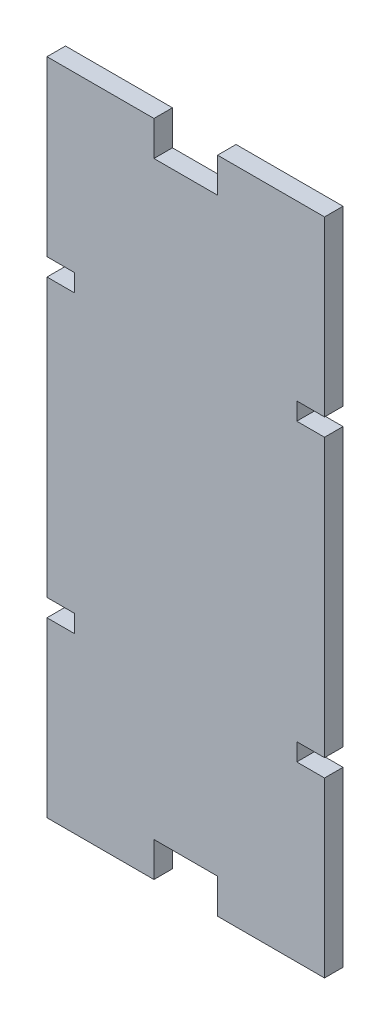
ISO-10303-21;
HEADER;
FILE_DESCRIPTION(('STEP AP214'),'2;1');
FILE_NAME('part.step','',(''),(''),'','','');
FILE_SCHEMA(('AUTOMOTIVE_DESIGN { 1 0 10303 214 1 1 1 1 }'));
ENDSEC;
DATA;
#1=APPLICATION_CONTEXT('core data for automotive mechanical design processes');
#2=APPLICATION_PROTOCOL_DEFINITION('international standard','automotive_design',2000,#1);
#3=PRODUCT_CONTEXT('',#1,'mechanical');
#4=PRODUCT('Part','Part','',(#3));
#5=PRODUCT_RELATED_PRODUCT_CATEGORY('part','',(#4));
#6=PRODUCT_DEFINITION_FORMATION('','',#4);
#7=PRODUCT_DEFINITION_CONTEXT('part definition',#1,'design');
#8=PRODUCT_DEFINITION('design','',#6,#7);
#9=PRODUCT_DEFINITION_SHAPE('','',#8);
#10=(LENGTH_UNIT() NAMED_UNIT(*) SI_UNIT(.MILLI.,.METRE.));
#11=(NAMED_UNIT(*) PLANE_ANGLE_UNIT() SI_UNIT($,.RADIAN.));
#12=(NAMED_UNIT(*) SI_UNIT($,.STERADIAN.) SOLID_ANGLE_UNIT());
#13=UNCERTAINTY_MEASURE_WITH_UNIT(LENGTH_MEASURE(1.E-05),#10,'distance_accuracy_value','');
#14=(GEOMETRIC_REPRESENTATION_CONTEXT(3) GLOBAL_UNCERTAINTY_ASSIGNED_CONTEXT((#13)) GLOBAL_UNIT_ASSIGNED_CONTEXT((#10,
#11,#12)) REPRESENTATION_CONTEXT('',''));
#15=CARTESIAN_POINT('',(0.,0.,0.));
#16=DIRECTION('',(0.,0.,1.));
#17=DIRECTION('',(1.,0.,0.));
#18=AXIS2_PLACEMENT_3D('',#15,#16,#17);
#19=CARTESIAN_POINT('',(38.1,-90.4875,5.08));
#20=DIRECTION('',(-1.,0.,0.));
#21=DIRECTION('',(0.,0.,1.));
#22=AXIS2_PLACEMENT_3D('',#19,#20,#21);
#23=PLANE('',#22);
#24=DIRECTION('',(0.,1.,0.));
#25=VECTOR('',#24,1.);
#26=CARTESIAN_POINT('',(38.1,-90.4875,0.));
#27=LINE('',#26,#25);
#28=CARTESIAN_POINT('',(38.1,-90.4875,0.));
#29=VERTEX_POINT('',#28);
#30=CARTESIAN_POINT('',(38.1,-42.926,0.));
#31=VERTEX_POINT('',#30);
#32=EDGE_CURVE('E471',#29,#31,#27,.T.);
#33=ORIENTED_EDGE('',*,*,#32,.T.);
#34=DIRECTION('',(0.,0.,1.));
#35=VECTOR('',#34,1.);
#36=CARTESIAN_POINT('',(38.1,-42.926,0.));
#37=LINE('',#36,#35);
#38=CARTESIAN_POINT('',(38.1,-42.926,5.08));
#39=VERTEX_POINT('',#38);
#40=EDGE_CURVE('E288',#31,#39,#37,.T.);
#41=ORIENTED_EDGE('',*,*,#40,.T.);
#42=DIRECTION('',(0.,1.,0.));
#43=VECTOR('',#42,1.);
#44=CARTESIAN_POINT('',(38.1,-90.4875,5.08));
#45=LINE('',#44,#43);
#46=CARTESIAN_POINT('',(38.1,-90.4875,5.08));
#47=VERTEX_POINT('',#46);
#48=EDGE_CURVE('E449',#47,#39,#45,.T.);
#49=ORIENTED_EDGE('',*,*,#48,.F.);
#50=DIRECTION('',(0.,0.,-1.));
#51=VECTOR('',#50,1.);
#52=CARTESIAN_POINT('',(38.1,-90.4875,5.08));
#53=LINE('',#52,#51);
#54=EDGE_CURVE('E470',#47,#29,#53,.T.);
#55=ORIENTED_EDGE('',*,*,#54,.T.);
#56=EDGE_LOOP('',(#33,#41,#49,#55));
#57=FACE_BOUND('',#56,.T.);
#58=ADVANCED_FACE('F43',(#57),#23,.F.);
#59=CARTESIAN_POINT('',(38.1,-38.1,5.08));
#60=VERTEX_POINT('',#59);
#61=CARTESIAN_POINT('',(38.1,38.1,5.08));
#62=VERTEX_POINT('',#61);
#63=EDGE_CURVE('E257',#60,#62,#45,.T.);
#64=ORIENTED_EDGE('',*,*,#63,.F.);
#65=DIRECTION('',(0.,0.,1.));
#66=VECTOR('',#65,1.);
#67=CARTESIAN_POINT('',(38.1,-38.1,0.));
#68=LINE('',#67,#66);
#69=CARTESIAN_POINT('',(38.1,-38.1,0.));
#70=VERTEX_POINT('',#69);
#71=EDGE_CURVE('E278',#70,#60,#68,.T.);
#72=ORIENTED_EDGE('',*,*,#71,.F.);
#73=CARTESIAN_POINT('',(38.1,38.1,0.));
#74=VERTEX_POINT('',#73);
#75=EDGE_CURVE('E476',#70,#74,#27,.T.);
#76=ORIENTED_EDGE('',*,*,#75,.T.);
#77=DIRECTION('',(0.,0.,1.));
#78=VECTOR('',#77,1.);
#79=CARTESIAN_POINT('',(38.1,38.1,0.));
#80=LINE('',#79,#78);
#81=EDGE_CURVE('E272',#74,#62,#80,.T.);
#82=ORIENTED_EDGE('',*,*,#81,.T.);
#83=EDGE_LOOP('',(#64,#72,#76,#82));
#84=FACE_BOUND('',#83,.T.);
#85=ADVANCED_FACE('F551',(#84),#23,.F.);
#86=CARTESIAN_POINT('',(-38.1,-90.4875,5.08));
#87=DIRECTION('',(1.,0.,0.));
#88=DIRECTION('',(0.,0.,-1.));
#89=AXIS2_PLACEMENT_3D('',#86,#87,#88);
#90=PLANE('',#89);
#91=DIRECTION('',(0.,-1.,0.));
#92=VECTOR('',#91,1.);
#93=CARTESIAN_POINT('',(-38.1,-90.4875,0.));
#94=LINE('',#93,#92);
#95=CARTESIAN_POINT('',(-38.1,38.1,0.));
#96=VERTEX_POINT('',#95);
#97=CARTESIAN_POINT('',(-38.1,-38.1,0.));
#98=VERTEX_POINT('',#97);
#99=EDGE_CURVE('E487',#96,#98,#94,.T.);
#100=ORIENTED_EDGE('',*,*,#99,.T.);
#101=DIRECTION('',(0.,0.,1.));
#102=VECTOR('',#101,1.);
#103=CARTESIAN_POINT('',(-38.1,-38.1,0.));
#104=LINE('',#103,#102);
#105=CARTESIAN_POINT('',(-38.1,-38.1,5.08));
#106=VERTEX_POINT('',#105);
#107=EDGE_CURVE('E312',#98,#106,#104,.T.);
#108=ORIENTED_EDGE('',*,*,#107,.T.);
#109=DIRECTION('',(0.,-1.,0.));
#110=VECTOR('',#109,1.);
#111=CARTESIAN_POINT('',(-38.1,-90.4875,5.08));
#112=LINE('',#111,#110);
#113=CARTESIAN_POINT('',(-38.1,38.1,5.08));
#114=VERTEX_POINT('',#113);
#115=EDGE_CURVE('E465',#114,#106,#112,.T.);
#116=ORIENTED_EDGE('',*,*,#115,.F.);
#117=DIRECTION('',(0.,0.,1.));
#118=VECTOR('',#117,1.);
#119=CARTESIAN_POINT('',(-38.1,38.1,0.));
#120=LINE('',#119,#118);
#121=EDGE_CURVE('E357',#96,#114,#120,.T.);
#122=ORIENTED_EDGE('',*,*,#121,.F.);
#123=EDGE_LOOP('',(#100,#108,#116,#122));
#124=FACE_BOUND('',#123,.T.);
#125=ADVANCED_FACE('F603',(#124),#90,.F.);
#126=CARTESIAN_POINT('',(-38.1,90.4875,0.));
#127=VERTEX_POINT('',#126);
#128=CARTESIAN_POINT('',(-38.1,42.926,0.));
#129=VERTEX_POINT('',#128);
#130=EDGE_CURVE('E482',#127,#129,#94,.T.);
#131=ORIENTED_EDGE('',*,*,#130,.T.);
#132=DIRECTION('',(0.,0.,1.));
#133=VECTOR('',#132,1.);
#134=CARTESIAN_POINT('',(-38.1,42.926,0.));
#135=LINE('',#134,#133);
#136=CARTESIAN_POINT('',(-38.1,42.926,5.08));
#137=VERTEX_POINT('',#136);
#138=EDGE_CURVE('E364',#129,#137,#135,.T.);
#139=ORIENTED_EDGE('',*,*,#138,.T.);
#140=CARTESIAN_POINT('',(-38.1,90.4875,5.08));
#141=VERTEX_POINT('',#140);
#142=EDGE_CURVE('E460',#141,#137,#112,.T.);
#143=ORIENTED_EDGE('',*,*,#142,.F.);
#144=DIRECTION('',(0.,0.,-1.));
#145=VECTOR('',#144,1.);
#146=CARTESIAN_POINT('',(-38.1,90.4875,5.08));
#147=LINE('',#146,#145);
#148=EDGE_CURVE('E52',#141,#127,#147,.T.);
#149=ORIENTED_EDGE('',*,*,#148,.T.);
#150=EDGE_LOOP('',(#131,#139,#143,#149));
#151=FACE_BOUND('',#150,.T.);
#152=ADVANCED_FACE('F504',(#151),#90,.F.);
#153=CARTESIAN_POINT('',(-38.1,90.4875,5.08));
#154=DIRECTION('',(0.,-1.,0.));
#155=DIRECTION('',(0.,0.,-1.));
#156=AXIS2_PLACEMENT_3D('',#153,#154,#155);
#157=PLANE('',#156);
#158=DIRECTION('',(-1.,0.,0.));
#159=VECTOR('',#158,1.);
#160=CARTESIAN_POINT('',(-38.1,90.4875,0.));
#161=LINE('',#160,#159);
#162=CARTESIAN_POINT('',(38.1,90.4875,0.));
#163=VERTEX_POINT('',#162);
#164=CARTESIAN_POINT('',(8.73125,90.4875,0.));
#165=VERTEX_POINT('',#164);
#166=EDGE_CURVE('E477',#163,#165,#161,.T.);
#167=ORIENTED_EDGE('',*,*,#166,.T.);
#168=DIRECTION('',(0.,0.,1.));
#169=VECTOR('',#168,1.);
#170=CARTESIAN_POINT('',(8.73125,90.4875,0.));
#171=LINE('',#170,#169);
#172=CARTESIAN_POINT('',(8.73125,90.4875,5.08));
#173=VERTEX_POINT('',#172);
#174=EDGE_CURVE('E415',#165,#173,#171,.T.);
#175=ORIENTED_EDGE('',*,*,#174,.T.);
#176=DIRECTION('',(-1.,0.,0.));
#177=VECTOR('',#176,1.);
#178=CARTESIAN_POINT('',(-38.1,90.4875,5.08));
#179=LINE('',#178,#177);
#180=CARTESIAN_POINT('',(38.1,90.4875,5.08));
#181=VERTEX_POINT('',#180);
#182=EDGE_CURVE('E455',#181,#173,#179,.T.);
#183=ORIENTED_EDGE('',*,*,#182,.F.);
#184=DIRECTION('',(0.,0.,-1.));
#185=VECTOR('',#184,1.);
#186=CARTESIAN_POINT('',(38.1,90.4875,5.08));
#187=LINE('',#186,#185);
#188=EDGE_CURVE('E11',#181,#163,#187,.T.);
#189=ORIENTED_EDGE('',*,*,#188,.T.);
#190=EDGE_LOOP('',(#167,#175,#183,#189));
#191=FACE_BOUND('',#190,.T.);
#192=ADVANCED_FACE('F540',(#191),#157,.F.);
#193=CARTESIAN_POINT('',(-38.1,-90.4875,5.08));
#194=DIRECTION('',(0.,1.,0.));
#195=DIRECTION('',(0.,0.,1.));
#196=AXIS2_PLACEMENT_3D('',#193,#194,#195);
#197=PLANE('',#196);
#198=DIRECTION('',(1.,0.,0.));
#199=VECTOR('',#198,1.);
#200=CARTESIAN_POINT('',(-38.1,-90.4875,0.));
#201=LINE('',#200,#199);
#202=CARTESIAN_POINT('',(-38.1,-90.4875,0.));
#203=VERTEX_POINT('',#202);
#204=CARTESIAN_POINT('',(-8.73125,-90.4875,0.));
#205=VERTEX_POINT('',#204);
#206=EDGE_CURVE('E488',#203,#205,#201,.T.);
#207=ORIENTED_EDGE('',*,*,#206,.T.);
#208=DIRECTION('',(0.,0.,1.));
#209=VECTOR('',#208,1.);
#210=CARTESIAN_POINT('',(-8.73125,-90.4875,0.));
#211=LINE('',#210,#209);
#212=CARTESIAN_POINT('',(-8.73125,-90.4875,5.08));
#213=VERTEX_POINT('',#212);
#214=EDGE_CURVE('E402',#205,#213,#211,.T.);
#215=ORIENTED_EDGE('',*,*,#214,.T.);
#216=DIRECTION('',(1.,0.,0.));
#217=VECTOR('',#216,1.);
#218=CARTESIAN_POINT('',(-38.1,-90.4875,5.08));
#219=LINE('',#218,#217);
#220=CARTESIAN_POINT('',(-38.1,-90.4875,5.08));
#221=VERTEX_POINT('',#220);
#222=EDGE_CURVE('E466',#221,#213,#219,.T.);
#223=ORIENTED_EDGE('',*,*,#222,.F.);
#224=DIRECTION('',(0.,0.,-1.));
#225=VECTOR('',#224,1.);
#226=CARTESIAN_POINT('',(-38.1,-90.4875,5.08));
#227=LINE('',#226,#225);
#228=EDGE_CURVE('E495',#221,#203,#227,.T.);
#229=ORIENTED_EDGE('',*,*,#228,.T.);
#230=EDGE_LOOP('',(#207,#215,#223,#229));
#231=FACE_BOUND('',#230,.T.);
#232=ADVANCED_FACE('F584',(#231),#197,.F.);
#233=CARTESIAN_POINT('',(38.1,42.926,5.08));
#234=VERTEX_POINT('',#233);
#235=EDGE_CURVE('E454',#234,#181,#45,.T.);
#236=ORIENTED_EDGE('',*,*,#235,.F.);
#237=DIRECTION('',(0.,0.,1.));
#238=VECTOR('',#237,1.);
#239=CARTESIAN_POINT('',(38.1,42.926,0.));
#240=LINE('',#239,#238);
#241=CARTESIAN_POINT('',(38.1,42.926,0.));
#242=VERTEX_POINT('',#241);
#243=EDGE_CURVE('E536',#242,#234,#240,.T.);
#244=ORIENTED_EDGE('',*,*,#243,.F.);
#245=EDGE_CURVE('E406',#242,#163,#27,.T.);
#246=ORIENTED_EDGE('',*,*,#245,.T.);
#247=ORIENTED_EDGE('',*,*,#188,.F.);
#248=EDGE_LOOP('',(#236,#244,#246,#247));
#249=FACE_BOUND('',#248,.T.);
#250=ADVANCED_FACE('F45',(#249),#23,.F.);
#251=CARTESIAN_POINT('',(-8.73125,90.4875,5.08));
#252=VERTEX_POINT('',#251);
#253=EDGE_CURVE('E453',#252,#141,#179,.T.);
#254=ORIENTED_EDGE('',*,*,#253,.F.);
#255=DIRECTION('',(0.,0.,1.));
#256=VECTOR('',#255,1.);
#257=CARTESIAN_POINT('',(-8.73125,90.4875,0.));
#258=LINE('',#257,#256);
#259=CARTESIAN_POINT('',(-8.73125,90.4875,0.));
#260=VERTEX_POINT('',#259);
#261=EDGE_CURVE('E420',#260,#252,#258,.T.);
#262=ORIENTED_EDGE('',*,*,#261,.F.);
#263=EDGE_CURVE('E475',#260,#127,#161,.T.);
#264=ORIENTED_EDGE('',*,*,#263,.T.);
#265=ORIENTED_EDGE('',*,*,#148,.F.);
#266=EDGE_LOOP('',(#254,#262,#264,#265));
#267=FACE_BOUND('',#266,.T.);
#268=ADVANCED_FACE('F624',(#267),#157,.F.);
#269=CARTESIAN_POINT('',(-38.1,-42.926,5.08));
#270=VERTEX_POINT('',#269);
#271=EDGE_CURVE('E459',#270,#221,#112,.T.);
#272=ORIENTED_EDGE('',*,*,#271,.F.);
#273=DIRECTION('',(0.,0.,1.));
#274=VECTOR('',#273,1.);
#275=CARTESIAN_POINT('',(-38.1,-42.926,0.));
#276=LINE('',#275,#274);
#277=CARTESIAN_POINT('',(-38.1,-42.926,0.));
#278=VERTEX_POINT('',#277);
#279=EDGE_CURVE('E316',#278,#270,#276,.T.);
#280=ORIENTED_EDGE('',*,*,#279,.F.);
#281=EDGE_CURVE('E481',#278,#203,#94,.T.);
#282=ORIENTED_EDGE('',*,*,#281,.T.);
#283=ORIENTED_EDGE('',*,*,#228,.F.);
#284=EDGE_LOOP('',(#272,#280,#282,#283));
#285=FACE_BOUND('',#284,.T.);
#286=ADVANCED_FACE('F589',(#285),#90,.F.);
#287=CARTESIAN_POINT('',(8.73125,-90.4875,5.08));
#288=VERTEX_POINT('',#287);
#289=EDGE_CURVE('E464',#288,#47,#219,.T.);
#290=ORIENTED_EDGE('',*,*,#289,.F.);
#291=DIRECTION('',(0.,0.,1.));
#292=VECTOR('',#291,1.);
#293=CARTESIAN_POINT('',(8.73125,-90.4875,0.));
#294=LINE('',#293,#292);
#295=CARTESIAN_POINT('',(8.73125,-90.4875,0.));
#296=VERTEX_POINT('',#295);
#297=EDGE_CURVE('E390',#296,#288,#294,.T.);
#298=ORIENTED_EDGE('',*,*,#297,.F.);
#299=EDGE_CURVE('E486',#296,#29,#201,.T.);
#300=ORIENTED_EDGE('',*,*,#299,.T.);
#301=ORIENTED_EDGE('',*,*,#54,.F.);
#302=EDGE_LOOP('',(#290,#298,#300,#301));
#303=FACE_BOUND('',#302,.T.);
#304=ADVANCED_FACE('F570',(#303),#197,.F.);
#305=CARTESIAN_POINT('',(0.,0.,5.08));
#306=DIRECTION('',(0.,0.,-1.));
#307=DIRECTION('',(-1.,0.,0.));
#308=AXIS2_PLACEMENT_3D('',#305,#306,#307);
#309=PLANE('',#308);
#310=ORIENTED_EDGE('',*,*,#115,.T.);
#311=DIRECTION('',(-1.,0.,0.));
#312=VECTOR('',#311,1.);
#313=CARTESIAN_POINT('',(-30.48,-38.1,5.08));
#314=LINE('',#313,#312);
#315=CARTESIAN_POINT('',(-30.48,-38.1,5.08));
#316=VERTEX_POINT('',#315);
#317=EDGE_CURVE('E292',#316,#106,#314,.T.);
#318=ORIENTED_EDGE('',*,*,#317,.F.);
#319=DIRECTION('',(0.,1.,0.));
#320=VECTOR('',#319,1.);
#321=CARTESIAN_POINT('',(-30.48,-42.926,5.08));
#322=LINE('',#321,#320);
#323=CARTESIAN_POINT('',(-30.48,-42.926,5.08));
#324=VERTEX_POINT('',#323);
#325=EDGE_CURVE('E325',#324,#316,#322,.T.);
#326=ORIENTED_EDGE('',*,*,#325,.F.);
#327=DIRECTION('',(1.,0.,0.));
#328=VECTOR('',#327,1.);
#329=CARTESIAN_POINT('',(-38.1,-42.926,5.08));
#330=LINE('',#329,#328);
#331=EDGE_CURVE('E329',#270,#324,#330,.T.);
#332=ORIENTED_EDGE('',*,*,#331,.F.);
#333=ORIENTED_EDGE('',*,*,#271,.T.);
#334=ORIENTED_EDGE('',*,*,#222,.T.);
#335=DIRECTION('',(0.,-1.,0.));
#336=VECTOR('',#335,1.);
#337=CARTESIAN_POINT('',(-8.73125,-90.4875,5.08));
#338=LINE('',#337,#336);
#339=CARTESIAN_POINT('',(-8.73125,-80.9625,5.08));
#340=VERTEX_POINT('',#339);
#341=EDGE_CURVE('E382',#340,#213,#338,.T.);
#342=ORIENTED_EDGE('',*,*,#341,.F.);
#343=DIRECTION('',(-1.,0.,0.));
#344=VECTOR('',#343,1.);
#345=CARTESIAN_POINT('',(-8.73125,-80.9625,5.08));
#346=LINE('',#345,#344);
#347=CARTESIAN_POINT('',(8.73125,-80.9625,5.08));
#348=VERTEX_POINT('',#347);
#349=EDGE_CURVE('E395',#348,#340,#346,.T.);
#350=ORIENTED_EDGE('',*,*,#349,.F.);
#351=DIRECTION('',(0.,1.,0.));
#352=VECTOR('',#351,1.);
#353=CARTESIAN_POINT('',(8.73125,-80.9625,5.08));
#354=LINE('',#353,#352);
#355=EDGE_CURVE('E391',#288,#348,#354,.T.);
#356=ORIENTED_EDGE('',*,*,#355,.F.);
#357=ORIENTED_EDGE('',*,*,#289,.T.);
#358=ORIENTED_EDGE('',*,*,#48,.T.);
#359=DIRECTION('',(1.,0.,0.));
#360=VECTOR('',#359,1.);
#361=CARTESIAN_POINT('',(38.1,-42.926,5.08));
#362=LINE('',#361,#360);
#363=CARTESIAN_POINT('',(30.48,-42.926,5.08));
#364=VERTEX_POINT('',#363);
#365=EDGE_CURVE('E293',#364,#39,#362,.T.);
#366=ORIENTED_EDGE('',*,*,#365,.F.);
#367=DIRECTION('',(0.,-1.,0.));
#368=VECTOR('',#367,1.);
#369=CARTESIAN_POINT('',(30.48,-42.926,5.08));
#370=LINE('',#369,#368);
#371=CARTESIAN_POINT('',(30.48,-38.1,5.08));
#372=VERTEX_POINT('',#371);
#373=EDGE_CURVE('E296',#372,#364,#370,.T.);
#374=ORIENTED_EDGE('',*,*,#373,.F.);
#375=DIRECTION('',(-1.,0.,0.));
#376=VECTOR('',#375,1.);
#377=CARTESIAN_POINT('',(30.48,-38.1,5.08));
#378=LINE('',#377,#376);
#379=EDGE_CURVE('E240',#60,#372,#378,.T.);
#380=ORIENTED_EDGE('',*,*,#379,.F.);
#381=ORIENTED_EDGE('',*,*,#63,.T.);
#382=DIRECTION('',(1.,0.,0.));
#383=VECTOR('',#382,1.);
#384=CARTESIAN_POINT('',(30.48,38.1,5.08));
#385=LINE('',#384,#383);
#386=CARTESIAN_POINT('',(30.48,38.1,5.08));
#387=VERTEX_POINT('',#386);
#388=EDGE_CURVE('E232',#387,#62,#385,.T.);
#389=ORIENTED_EDGE('',*,*,#388,.F.);
#390=DIRECTION('',(0.,-1.,0.));
#391=VECTOR('',#390,1.);
#392=CARTESIAN_POINT('',(30.48,42.926,5.08));
#393=LINE('',#392,#391);
#394=CARTESIAN_POINT('',(30.48,42.926,5.08));
#395=VERTEX_POINT('',#394);
#396=EDGE_CURVE('E243',#395,#387,#393,.T.);
#397=ORIENTED_EDGE('',*,*,#396,.F.);
#398=DIRECTION('',(-1.,0.,0.));
#399=VECTOR('',#398,1.);
#400=CARTESIAN_POINT('',(38.1,42.926,5.08));
#401=LINE('',#400,#399);
#402=EDGE_CURVE('E250',#234,#395,#401,.T.);
#403=ORIENTED_EDGE('',*,*,#402,.F.);
#404=ORIENTED_EDGE('',*,*,#235,.T.);
#405=ORIENTED_EDGE('',*,*,#182,.T.);
#406=DIRECTION('',(0.,1.,0.));
#407=VECTOR('',#406,1.);
#408=CARTESIAN_POINT('',(8.73125,80.9625,5.08));
#409=LINE('',#408,#407);
#410=CARTESIAN_POINT('',(8.73125,80.9625,5.08));
#411=VERTEX_POINT('',#410);
#412=EDGE_CURVE('E396',#411,#173,#409,.T.);
#413=ORIENTED_EDGE('',*,*,#412,.F.);
#414=DIRECTION('',(1.,0.,0.));
#415=VECTOR('',#414,1.);
#416=CARTESIAN_POINT('',(-8.73125,80.9625,5.08));
#417=LINE('',#416,#415);
#418=CARTESIAN_POINT('',(-8.73125,80.9625,5.08));
#419=VERTEX_POINT('',#418);
#420=EDGE_CURVE('E428',#419,#411,#417,.T.);
#421=ORIENTED_EDGE('',*,*,#420,.F.);
#422=DIRECTION('',(0.,-1.,0.));
#423=VECTOR('',#422,1.);
#424=CARTESIAN_POINT('',(-8.73125,90.4875,5.08));
#425=LINE('',#424,#423);
#426=EDGE_CURVE('E432',#252,#419,#425,.T.);
#427=ORIENTED_EDGE('',*,*,#426,.F.);
#428=ORIENTED_EDGE('',*,*,#253,.T.);
#429=ORIENTED_EDGE('',*,*,#142,.T.);
#430=DIRECTION('',(-1.,0.,0.));
#431=VECTOR('',#430,1.);
#432=CARTESIAN_POINT('',(-38.1,42.926,5.08));
#433=LINE('',#432,#431);
#434=CARTESIAN_POINT('',(-30.48,42.926,5.08));
#435=VERTEX_POINT('',#434);
#436=EDGE_CURVE('E350',#435,#137,#433,.T.);
#437=ORIENTED_EDGE('',*,*,#436,.F.);
#438=DIRECTION('',(0.,1.,0.));
#439=VECTOR('',#438,1.);
#440=CARTESIAN_POINT('',(-30.48,42.926,5.08));
#441=LINE('',#440,#439);
#442=CARTESIAN_POINT('',(-30.48,38.1,5.08));
#443=VERTEX_POINT('',#442);
#444=EDGE_CURVE('E264',#443,#435,#441,.T.);
#445=ORIENTED_EDGE('',*,*,#444,.F.);
#446=DIRECTION('',(1.,0.,0.));
#447=VECTOR('',#446,1.);
#448=CARTESIAN_POINT('',(-30.48,38.1,5.08));
#449=LINE('',#448,#447);
#450=EDGE_CURVE('E259',#114,#443,#449,.T.);
#451=ORIENTED_EDGE('',*,*,#450,.F.);
#452=EDGE_LOOP('',(#310,#318,#326,#332,#333,#334,#342,#350,#356,#357,#358,#366,#374,#380,#381,
#389,#397,#403,#404,#405,#413,#421,#427,#428,#429,#437,#445,#451));
#453=FACE_BOUND('',#452,.T.);
#454=ADVANCED_FACE('F254',(#453),#309,.F.);
#455=CARTESIAN_POINT('',(0.,0.,0.));
#456=DIRECTION('',(0.,0.,-1.));
#457=DIRECTION('',(-1.,0.,0.));
#458=AXIS2_PLACEMENT_3D('',#455,#456,#457);
#459=PLANE('',#458);
#460=DIRECTION('',(-1.,0.,0.));
#461=VECTOR('',#460,1.);
#462=CARTESIAN_POINT('',(-30.48,-38.1,0.));
#463=LINE('',#462,#461);
#464=CARTESIAN_POINT('',(-30.48,-38.1,0.));
#465=VERTEX_POINT('',#464);
#466=EDGE_CURVE('E330',#465,#98,#463,.T.);
#467=ORIENTED_EDGE('',*,*,#466,.T.);
#468=ORIENTED_EDGE('',*,*,#99,.F.);
#469=DIRECTION('',(1.,0.,0.));
#470=VECTOR('',#469,1.);
#471=CARTESIAN_POINT('',(-30.48,38.1,0.));
#472=LINE('',#471,#470);
#473=CARTESIAN_POINT('',(-30.48,38.1,0.));
#474=VERTEX_POINT('',#473);
#475=EDGE_CURVE('E345',#96,#474,#472,.T.);
#476=ORIENTED_EDGE('',*,*,#475,.T.);
#477=DIRECTION('',(0.,1.,0.));
#478=VECTOR('',#477,1.);
#479=CARTESIAN_POINT('',(-30.48,42.926,0.));
#480=LINE('',#479,#478);
#481=CARTESIAN_POINT('',(-30.48,42.926,0.));
#482=VERTEX_POINT('',#481);
#483=EDGE_CURVE('E349',#474,#482,#480,.T.);
#484=ORIENTED_EDGE('',*,*,#483,.T.);
#485=DIRECTION('',(-1.,0.,0.));
#486=VECTOR('',#485,1.);
#487=CARTESIAN_POINT('',(-38.1,42.926,0.));
#488=LINE('',#487,#486);
#489=EDGE_CURVE('E354',#482,#129,#488,.T.);
#490=ORIENTED_EDGE('',*,*,#489,.T.);
#491=ORIENTED_EDGE('',*,*,#130,.F.);
#492=ORIENTED_EDGE('',*,*,#263,.F.);
#493=DIRECTION('',(0.,-1.,0.));
#494=VECTOR('',#493,1.);
#495=CARTESIAN_POINT('',(-8.73125,90.4875,0.));
#496=LINE('',#495,#494);
#497=CARTESIAN_POINT('',(-8.73125,80.9625,0.));
#498=VERTEX_POINT('',#497);
#499=EDGE_CURVE('E442',#260,#498,#496,.T.);
#500=ORIENTED_EDGE('',*,*,#499,.T.);
#501=DIRECTION('',(1.,0.,0.));
#502=VECTOR('',#501,1.);
#503=CARTESIAN_POINT('',(-8.73125,80.9625,0.));
#504=LINE('',#503,#502);
#505=CARTESIAN_POINT('',(8.73125,80.9625,0.));
#506=VERTEX_POINT('',#505);
#507=EDGE_CURVE('E419',#498,#506,#504,.T.);
#508=ORIENTED_EDGE('',*,*,#507,.T.);
#509=DIRECTION('',(0.,1.,0.));
#510=VECTOR('',#509,1.);
#511=CARTESIAN_POINT('',(8.73125,80.9625,0.));
#512=LINE('',#511,#510);
#513=EDGE_CURVE('E433',#506,#165,#512,.T.);
#514=ORIENTED_EDGE('',*,*,#513,.T.);
#515=ORIENTED_EDGE('',*,*,#166,.F.);
#516=ORIENTED_EDGE('',*,*,#245,.F.);
#517=DIRECTION('',(-1.,0.,0.));
#518=VECTOR('',#517,1.);
#519=CARTESIAN_POINT('',(38.1,42.926,0.));
#520=LINE('',#519,#518);
#521=CARTESIAN_POINT('',(30.48,42.926,0.));
#522=VERTEX_POINT('',#521);
#523=EDGE_CURVE('E271',#242,#522,#520,.T.);
#524=ORIENTED_EDGE('',*,*,#523,.T.);
#525=DIRECTION('',(0.,-1.,0.));
#526=VECTOR('',#525,1.);
#527=CARTESIAN_POINT('',(30.48,42.926,0.));
#528=LINE('',#527,#526);
#529=CARTESIAN_POINT('',(30.48,38.1,0.));
#530=VERTEX_POINT('',#529);
#531=EDGE_CURVE('E268',#522,#530,#528,.T.);
#532=ORIENTED_EDGE('',*,*,#531,.T.);
#533=DIRECTION('',(1.,0.,0.));
#534=VECTOR('',#533,1.);
#535=CARTESIAN_POINT('',(30.48,38.1,0.));
#536=LINE('',#535,#534);
#537=EDGE_CURVE('E235',#530,#74,#536,.T.);
#538=ORIENTED_EDGE('',*,*,#537,.T.);
#539=ORIENTED_EDGE('',*,*,#75,.F.);
#540=DIRECTION('',(-1.,0.,0.));
#541=VECTOR('',#540,1.);
#542=CARTESIAN_POINT('',(30.48,-38.1,0.));
#543=LINE('',#542,#541);
#544=CARTESIAN_POINT('',(30.48,-38.1,0.));
#545=VERTEX_POINT('',#544);
#546=EDGE_CURVE('E297',#70,#545,#543,.T.);
#547=ORIENTED_EDGE('',*,*,#546,.T.);
#548=DIRECTION('',(0.,-1.,0.));
#549=VECTOR('',#548,1.);
#550=CARTESIAN_POINT('',(30.48,-42.926,0.));
#551=LINE('',#550,#549);
#552=CARTESIAN_POINT('',(30.48,-42.926,0.));
#553=VERTEX_POINT('',#552);
#554=EDGE_CURVE('E67',#545,#553,#551,.T.);
#555=ORIENTED_EDGE('',*,*,#554,.T.);
#556=DIRECTION('',(1.,0.,0.));
#557=VECTOR('',#556,1.);
#558=CARTESIAN_POINT('',(38.1,-42.926,0.));
#559=LINE('',#558,#557);
#560=EDGE_CURVE('E281',#553,#31,#559,.T.);
#561=ORIENTED_EDGE('',*,*,#560,.T.);
#562=ORIENTED_EDGE('',*,*,#32,.F.);
#563=ORIENTED_EDGE('',*,*,#299,.F.);
#564=DIRECTION('',(0.,1.,0.));
#565=VECTOR('',#564,1.);
#566=CARTESIAN_POINT('',(8.73125,-80.9625,0.));
#567=LINE('',#566,#565);
#568=CARTESIAN_POINT('',(8.73125,-80.9625,0.));
#569=VERTEX_POINT('',#568);
#570=EDGE_CURVE('E377',#296,#569,#567,.T.);
#571=ORIENTED_EDGE('',*,*,#570,.T.);
#572=DIRECTION('',(-1.,0.,0.));
#573=VECTOR('',#572,1.);
#574=CARTESIAN_POINT('',(-8.73125,-80.9625,0.));
#575=LINE('',#574,#573);
#576=CARTESIAN_POINT('',(-8.73125,-80.9625,0.));
#577=VERTEX_POINT('',#576);
#578=EDGE_CURVE('E381',#569,#577,#575,.T.);
#579=ORIENTED_EDGE('',*,*,#578,.T.);
#580=DIRECTION('',(0.,-1.,0.));
#581=VECTOR('',#580,1.);
#582=CARTESIAN_POINT('',(-8.73125,-90.4875,0.));
#583=LINE('',#582,#581);
#584=EDGE_CURVE('E386',#577,#205,#583,.T.);
#585=ORIENTED_EDGE('',*,*,#584,.T.);
#586=ORIENTED_EDGE('',*,*,#206,.F.);
#587=ORIENTED_EDGE('',*,*,#281,.F.);
#588=DIRECTION('',(1.,0.,0.));
#589=VECTOR('',#588,1.);
#590=CARTESIAN_POINT('',(-38.1,-42.926,0.));
#591=LINE('',#590,#589);
#592=CARTESIAN_POINT('',(-30.48,-42.926,0.));
#593=VERTEX_POINT('',#592);
#594=EDGE_CURVE('E338',#278,#593,#591,.T.);
#595=ORIENTED_EDGE('',*,*,#594,.T.);
#596=DIRECTION('',(0.,1.,0.));
#597=VECTOR('',#596,1.);
#598=CARTESIAN_POINT('',(-30.48,-42.926,0.));
#599=LINE('',#598,#597);
#600=EDGE_CURVE('E59',#593,#465,#599,.T.);
#601=ORIENTED_EDGE('',*,*,#600,.T.);
#602=EDGE_LOOP('',(#467,#468,#476,#484,#490,#491,#492,#500,#508,#514,#515,#516,#524,#532,#538,
#539,#547,#555,#561,#562,#563,#571,#579,#585,#586,#587,#595,#601));
#603=FACE_BOUND('',#602,.T.);
#604=ADVANCED_FACE('F509',(#603),#459,.T.);
#605=CARTESIAN_POINT('',(8.73125,80.9625,0.));
#606=DIRECTION('',(1.,0.,0.));
#607=DIRECTION('',(0.,1.,0.));
#608=AXIS2_PLACEMENT_3D('',#605,#606,#607);
#609=PLANE('',#608);
#610=ORIENTED_EDGE('',*,*,#412,.T.);
#611=ORIENTED_EDGE('',*,*,#174,.F.);
#612=ORIENTED_EDGE('',*,*,#513,.F.);
#613=DIRECTION('',(0.,0.,1.));
#614=VECTOR('',#613,1.);
#615=CARTESIAN_POINT('',(8.73125,80.9625,0.));
#616=LINE('',#615,#614);
#617=EDGE_CURVE('E368',#506,#411,#616,.T.);
#618=ORIENTED_EDGE('',*,*,#617,.T.);
#619=EDGE_LOOP('',(#610,#611,#612,#618));
#620=FACE_BOUND('',#619,.T.);
#621=ADVANCED_FACE('F679',(#620),#609,.F.);
#622=CARTESIAN_POINT('',(-8.73125,80.9625,0.));
#623=DIRECTION('',(0.,-1.,0.));
#624=DIRECTION('',(0.,0.,-1.));
#625=AXIS2_PLACEMENT_3D('',#622,#623,#624);
#626=PLANE('',#625);
#627=ORIENTED_EDGE('',*,*,#420,.T.);
#628=ORIENTED_EDGE('',*,*,#617,.F.);
#629=ORIENTED_EDGE('',*,*,#507,.F.);
#630=DIRECTION('',(0.,0.,1.));
#631=VECTOR('',#630,1.);
#632=CARTESIAN_POINT('',(-8.73125,80.9625,0.));
#633=LINE('',#632,#631);
#634=EDGE_CURVE('E423',#498,#419,#633,.T.);
#635=ORIENTED_EDGE('',*,*,#634,.T.);
#636=EDGE_LOOP('',(#627,#628,#629,#635));
#637=FACE_BOUND('',#636,.T.);
#638=ADVANCED_FACE('F684',(#637),#626,.F.);
#639=CARTESIAN_POINT('',(-8.73125,90.4875,0.));
#640=DIRECTION('',(-1.,0.,0.));
#641=DIRECTION('',(0.,-1.,0.));
#642=AXIS2_PLACEMENT_3D('',#639,#640,#641);
#643=PLANE('',#642);
#644=ORIENTED_EDGE('',*,*,#426,.T.);
#645=ORIENTED_EDGE('',*,*,#634,.F.);
#646=ORIENTED_EDGE('',*,*,#499,.F.);
#647=ORIENTED_EDGE('',*,*,#261,.T.);
#648=EDGE_LOOP('',(#644,#645,#646,#647));
#649=FACE_BOUND('',#648,.T.);
#650=ADVANCED_FACE('F695',(#649),#643,.F.);
#651=CARTESIAN_POINT('',(-8.73125,-90.4875,0.));
#652=DIRECTION('',(-1.,0.,0.));
#653=DIRECTION('',(0.,0.,1.));
#654=AXIS2_PLACEMENT_3D('',#651,#652,#653);
#655=PLANE('',#654);
#656=ORIENTED_EDGE('',*,*,#341,.T.);
#657=ORIENTED_EDGE('',*,*,#214,.F.);
#658=ORIENTED_EDGE('',*,*,#584,.F.);
#659=DIRECTION('',(0.,0.,1.));
#660=VECTOR('',#659,1.);
#661=CARTESIAN_POINT('',(-8.73125,-80.9625,0.));
#662=LINE('',#661,#660);
#663=EDGE_CURVE('E407',#577,#340,#662,.T.);
#664=ORIENTED_EDGE('',*,*,#663,.T.);
#665=EDGE_LOOP('',(#656,#657,#658,#664));
#666=FACE_BOUND('',#665,.T.);
#667=ADVANCED_FACE('F706',(#666),#655,.F.);
#668=CARTESIAN_POINT('',(-8.73125,-80.9625,0.));
#669=DIRECTION('',(0.,1.,0.));
#670=DIRECTION('',(0.,0.,1.));
#671=AXIS2_PLACEMENT_3D('',#668,#669,#670);
#672=PLANE('',#671);
#673=ORIENTED_EDGE('',*,*,#349,.T.);
#674=ORIENTED_EDGE('',*,*,#663,.F.);
#675=ORIENTED_EDGE('',*,*,#578,.F.);
#676=DIRECTION('',(0.,0.,1.));
#677=VECTOR('',#676,1.);
#678=CARTESIAN_POINT('',(8.73125,-80.9625,0.));
#679=LINE('',#678,#677);
#680=EDGE_CURVE('E410',#569,#348,#679,.T.);
#681=ORIENTED_EDGE('',*,*,#680,.T.);
#682=EDGE_LOOP('',(#673,#674,#675,#681));
#683=FACE_BOUND('',#682,.T.);
#684=ADVANCED_FACE('F578',(#683),#672,.F.);
#685=CARTESIAN_POINT('',(8.73125,-80.9625,0.));
#686=DIRECTION('',(1.,0.,0.));
#687=DIRECTION('',(0.,1.,0.));
#688=AXIS2_PLACEMENT_3D('',#685,#686,#687);
#689=PLANE('',#688);
#690=ORIENTED_EDGE('',*,*,#355,.T.);
#691=ORIENTED_EDGE('',*,*,#680,.F.);
#692=ORIENTED_EDGE('',*,*,#570,.F.);
#693=ORIENTED_EDGE('',*,*,#297,.T.);
#694=EDGE_LOOP('',(#690,#691,#692,#693));
#695=FACE_BOUND('',#694,.T.);
#696=ADVANCED_FACE('F573',(#695),#689,.F.);
#697=CARTESIAN_POINT('',(-38.1,42.926,0.));
#698=DIRECTION('',(0.,1.,0.));
#699=DIRECTION('',(0.,0.,1.));
#700=AXIS2_PLACEMENT_3D('',#697,#698,#699);
#701=PLANE('',#700);
#702=ORIENTED_EDGE('',*,*,#436,.T.);
#703=ORIENTED_EDGE('',*,*,#138,.F.);
#704=ORIENTED_EDGE('',*,*,#489,.F.);
#705=DIRECTION('',(0.,0.,1.));
#706=VECTOR('',#705,1.);
#707=CARTESIAN_POINT('',(-30.48,42.926,0.));
#708=LINE('',#707,#706);
#709=EDGE_CURVE('E369',#482,#435,#708,.T.);
#710=ORIENTED_EDGE('',*,*,#709,.T.);
#711=EDGE_LOOP('',(#702,#703,#704,#710));
#712=FACE_BOUND('',#711,.T.);
#713=ADVANCED_FACE('F512',(#712),#701,.F.);
#714=CARTESIAN_POINT('',(-30.48,42.926,0.));
#715=DIRECTION('',(1.,0.,0.));
#716=DIRECTION('',(0.,0.,-1.));
#717=AXIS2_PLACEMENT_3D('',#714,#715,#716);
#718=PLANE('',#717);
#719=ORIENTED_EDGE('',*,*,#444,.T.);
#720=ORIENTED_EDGE('',*,*,#709,.F.);
#721=ORIENTED_EDGE('',*,*,#483,.F.);
#722=DIRECTION('',(0.,0.,1.));
#723=VECTOR('',#722,1.);
#724=CARTESIAN_POINT('',(-30.48,38.1,0.));
#725=LINE('',#724,#723);
#726=EDGE_CURVE('E372',#474,#443,#725,.T.);
#727=ORIENTED_EDGE('',*,*,#726,.T.);
#728=EDGE_LOOP('',(#719,#720,#721,#727));
#729=FACE_BOUND('',#728,.T.);
#730=ADVANCED_FACE('F610',(#729),#718,.F.);
#731=CARTESIAN_POINT('',(-30.48,38.1,0.));
#732=DIRECTION('',(0.,-1.,0.));
#733=DIRECTION('',(0.,0.,-1.));
#734=AXIS2_PLACEMENT_3D('',#731,#732,#733);
#735=PLANE('',#734);
#736=ORIENTED_EDGE('',*,*,#450,.T.);
#737=ORIENTED_EDGE('',*,*,#726,.F.);
#738=ORIENTED_EDGE('',*,*,#475,.F.);
#739=ORIENTED_EDGE('',*,*,#121,.T.);
#740=EDGE_LOOP('',(#736,#737,#738,#739));
#741=FACE_BOUND('',#740,.T.);
#742=ADVANCED_FACE('F608',(#741),#735,.F.);
#743=CARTESIAN_POINT('',(30.48,38.1,0.));
#744=DIRECTION('',(0.,-1.,0.));
#745=DIRECTION('',(0.,0.,-1.));
#746=AXIS2_PLACEMENT_3D('',#743,#744,#745);
#747=PLANE('',#746);
#748=ORIENTED_EDGE('',*,*,#388,.T.);
#749=ORIENTED_EDGE('',*,*,#81,.F.);
#750=ORIENTED_EDGE('',*,*,#537,.F.);
#751=DIRECTION('',(0.,0.,1.));
#752=VECTOR('',#751,1.);
#753=CARTESIAN_POINT('',(30.48,38.1,0.));
#754=LINE('',#753,#752);
#755=EDGE_CURVE('E228',#530,#387,#754,.T.);
#756=ORIENTED_EDGE('',*,*,#755,.T.);
#757=EDGE_LOOP('',(#748,#749,#750,#756));
#758=FACE_BOUND('',#757,.T.);
#759=ADVANCED_FACE('F230',(#758),#747,.F.);
#760=CARTESIAN_POINT('',(30.48,42.926,0.));
#761=DIRECTION('',(-1.,0.,0.));
#762=DIRECTION('',(0.,0.,1.));
#763=AXIS2_PLACEMENT_3D('',#760,#761,#762);
#764=PLANE('',#763);
#765=ORIENTED_EDGE('',*,*,#396,.T.);
#766=ORIENTED_EDGE('',*,*,#755,.F.);
#767=ORIENTED_EDGE('',*,*,#531,.F.);
#768=DIRECTION('',(0.,0.,1.));
#769=VECTOR('',#768,1.);
#770=CARTESIAN_POINT('',(30.48,42.926,0.));
#771=LINE('',#770,#769);
#772=EDGE_CURVE('E239',#522,#395,#771,.T.);
#773=ORIENTED_EDGE('',*,*,#772,.T.);
#774=EDGE_LOOP('',(#765,#766,#767,#773));
#775=FACE_BOUND('',#774,.T.);
#776=ADVANCED_FACE('F244',(#775),#764,.F.);
#777=CARTESIAN_POINT('',(38.1,42.926,0.));
#778=DIRECTION('',(0.,1.,0.));
#779=DIRECTION('',(0.,0.,1.));
#780=AXIS2_PLACEMENT_3D('',#777,#778,#779);
#781=PLANE('',#780);
#782=ORIENTED_EDGE('',*,*,#402,.T.);
#783=ORIENTED_EDGE('',*,*,#772,.F.);
#784=ORIENTED_EDGE('',*,*,#523,.F.);
#785=ORIENTED_EDGE('',*,*,#243,.T.);
#786=EDGE_LOOP('',(#782,#783,#784,#785));
#787=FACE_BOUND('',#786,.T.);
#788=ADVANCED_FACE('F543',(#787),#781,.F.);
#789=CARTESIAN_POINT('',(38.1,-42.926,0.));
#790=DIRECTION('',(0.,-1.,0.));
#791=DIRECTION('',(0.,0.,-1.));
#792=AXIS2_PLACEMENT_3D('',#789,#790,#791);
#793=PLANE('',#792);
#794=ORIENTED_EDGE('',*,*,#365,.T.);
#795=ORIENTED_EDGE('',*,*,#40,.F.);
#796=ORIENTED_EDGE('',*,*,#560,.F.);
#797=DIRECTION('',(0.,0.,1.));
#798=VECTOR('',#797,1.);
#799=CARTESIAN_POINT('',(30.48,-42.926,0.));
#800=LINE('',#799,#798);
#801=EDGE_CURVE('E285',#553,#364,#800,.T.);
#802=ORIENTED_EDGE('',*,*,#801,.T.);
#803=EDGE_LOOP('',(#794,#795,#796,#802));
#804=FACE_BOUND('',#803,.T.);
#805=ADVANCED_FACE('F562',(#804),#793,.F.);
#806=CARTESIAN_POINT('',(30.48,-42.926,0.));
#807=DIRECTION('',(-1.,0.,0.));
#808=DIRECTION('',(0.,-1.,0.));
#809=AXIS2_PLACEMENT_3D('',#806,#807,#808);
#810=PLANE('',#809);
#811=ORIENTED_EDGE('',*,*,#373,.T.);
#812=ORIENTED_EDGE('',*,*,#801,.F.);
#813=ORIENTED_EDGE('',*,*,#554,.F.);
#814=DIRECTION('',(0.,0.,1.));
#815=VECTOR('',#814,1.);
#816=CARTESIAN_POINT('',(30.48,-38.1,0.));
#817=LINE('',#816,#815);
#818=EDGE_CURVE('E282',#545,#372,#817,.T.);
#819=ORIENTED_EDGE('',*,*,#818,.T.);
#820=EDGE_LOOP('',(#811,#812,#813,#819));
#821=FACE_BOUND('',#820,.T.);
#822=ADVANCED_FACE('F557',(#821),#810,.F.);
#823=CARTESIAN_POINT('',(30.48,-38.1,0.));
#824=DIRECTION('',(0.,1.,0.));
#825=DIRECTION('',(0.,0.,1.));
#826=AXIS2_PLACEMENT_3D('',#823,#824,#825);
#827=PLANE('',#826);
#828=ORIENTED_EDGE('',*,*,#379,.T.);
#829=ORIENTED_EDGE('',*,*,#818,.F.);
#830=ORIENTED_EDGE('',*,*,#546,.F.);
#831=ORIENTED_EDGE('',*,*,#71,.T.);
#832=EDGE_LOOP('',(#828,#829,#830,#831));
#833=FACE_BOUND('',#832,.T.);
#834=ADVANCED_FACE('F555',(#833),#827,.F.);
#835=CARTESIAN_POINT('',(-30.48,-38.1,0.));
#836=DIRECTION('',(0.,1.,0.));
#837=DIRECTION('',(0.,0.,1.));
#838=AXIS2_PLACEMENT_3D('',#835,#836,#837);
#839=PLANE('',#838);
#840=ORIENTED_EDGE('',*,*,#317,.T.);
#841=ORIENTED_EDGE('',*,*,#107,.F.);
#842=ORIENTED_EDGE('',*,*,#466,.F.);
#843=DIRECTION('',(0.,0.,1.));
#844=VECTOR('',#843,1.);
#845=CARTESIAN_POINT('',(-30.48,-38.1,0.));
#846=LINE('',#845,#844);
#847=EDGE_CURVE('E322',#465,#316,#846,.T.);
#848=ORIENTED_EDGE('',*,*,#847,.T.);
#849=EDGE_LOOP('',(#840,#841,#842,#848));
#850=FACE_BOUND('',#849,.T.);
#851=ADVANCED_FACE('F601',(#850),#839,.F.);
#852=CARTESIAN_POINT('',(-30.48,-42.926,0.));
#853=DIRECTION('',(1.,0.,0.));
#854=DIRECTION('',(0.,1.,0.));
#855=AXIS2_PLACEMENT_3D('',#852,#853,#854);
#856=PLANE('',#855);
#857=ORIENTED_EDGE('',*,*,#325,.T.);
#858=ORIENTED_EDGE('',*,*,#847,.F.);
#859=ORIENTED_EDGE('',*,*,#600,.F.);
#860=DIRECTION('',(0.,0.,1.));
#861=VECTOR('',#860,1.);
#862=CARTESIAN_POINT('',(-30.48,-42.926,0.));
#863=LINE('',#862,#861);
#864=EDGE_CURVE('E319',#593,#324,#863,.T.);
#865=ORIENTED_EDGE('',*,*,#864,.T.);
#866=EDGE_LOOP('',(#857,#858,#859,#865));
#867=FACE_BOUND('',#866,.T.);
#868=ADVANCED_FACE('F595',(#867),#856,.F.);
#869=CARTESIAN_POINT('',(-38.1,-42.926,0.));
#870=DIRECTION('',(0.,-1.,0.));
#871=DIRECTION('',(0.,0.,-1.));
#872=AXIS2_PLACEMENT_3D('',#869,#870,#871);
#873=PLANE('',#872);
#874=ORIENTED_EDGE('',*,*,#331,.T.);
#875=ORIENTED_EDGE('',*,*,#864,.F.);
#876=ORIENTED_EDGE('',*,*,#594,.F.);
#877=ORIENTED_EDGE('',*,*,#279,.T.);
#878=EDGE_LOOP('',(#874,#875,#876,#877));
#879=FACE_BOUND('',#878,.T.);
#880=ADVANCED_FACE('F592',(#879),#873,.F.);
#881=CLOSED_SHELL('',(#58,#85,#125,#152,#192,#232,#250,#268,#286,#304,#454,#604,#621,#638,#650,
#667,#684,#696,#713,#730,#742,#759,#776,#788,#805,#822,#834,#851,#868,#880));
#882=MANIFOLD_SOLID_BREP('B2',#881);
#883=ADVANCED_BREP_SHAPE_REPRESENTATION('',(#18,#882),#14);
#884=SHAPE_DEFINITION_REPRESENTATION(#9,#883);
ENDSEC;
END-ISO-10303-21;
